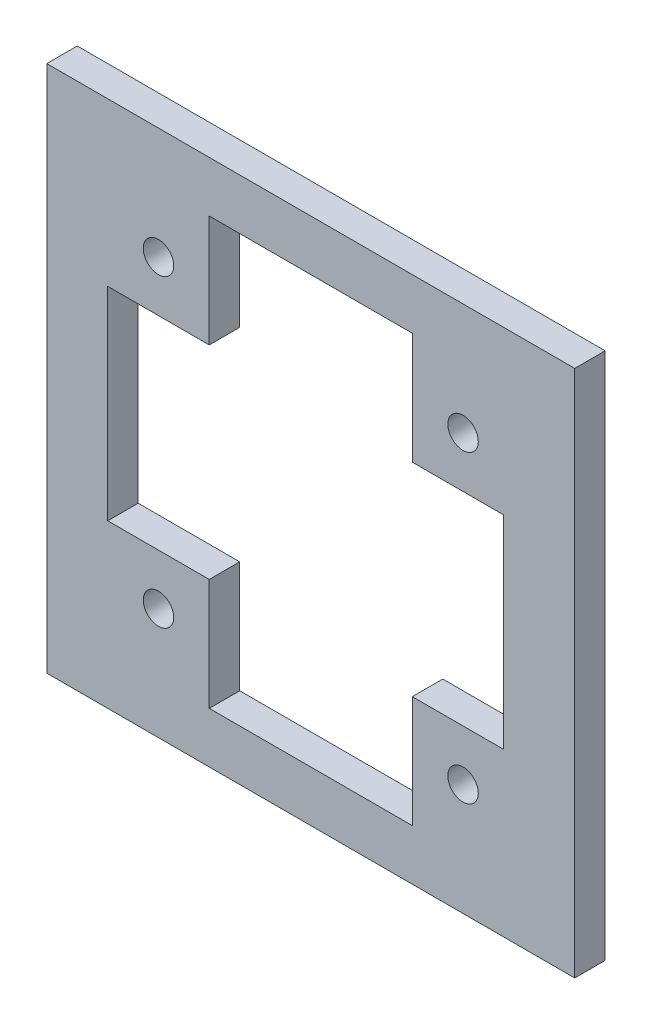
ISO-10303-21;
HEADER;
FILE_DESCRIPTION(('STEP AP214'),'2;1');
FILE_NAME('part.step','',(''),(''),'','','');
FILE_SCHEMA(('AUTOMOTIVE_DESIGN { 1 0 10303 214 1 1 1 1 }'));
ENDSEC;
DATA;
#1=APPLICATION_CONTEXT('core data for automotive mechanical design processes');
#2=APPLICATION_PROTOCOL_DEFINITION('international standard','automotive_design',2000,#1);
#3=PRODUCT_CONTEXT('',#1,'mechanical');
#4=PRODUCT('Part','Part','',(#3));
#5=PRODUCT_RELATED_PRODUCT_CATEGORY('part','',(#4));
#6=PRODUCT_DEFINITION_FORMATION('','',#4);
#7=PRODUCT_DEFINITION_CONTEXT('part definition',#1,'design');
#8=PRODUCT_DEFINITION('design','',#6,#7);
#9=PRODUCT_DEFINITION_SHAPE('','',#8);
#10=(LENGTH_UNIT() NAMED_UNIT(*) SI_UNIT(.MILLI.,.METRE.));
#11=(NAMED_UNIT(*) PLANE_ANGLE_UNIT() SI_UNIT($,.RADIAN.));
#12=(NAMED_UNIT(*) SI_UNIT($,.STERADIAN.) SOLID_ANGLE_UNIT());
#13=UNCERTAINTY_MEASURE_WITH_UNIT(LENGTH_MEASURE(1.E-05),#10,'distance_accuracy_value','');
#14=(GEOMETRIC_REPRESENTATION_CONTEXT(3) GLOBAL_UNCERTAINTY_ASSIGNED_CONTEXT((#13)) GLOBAL_UNIT_ASSIGNED_CONTEXT((#10,
#11,#12)) REPRESENTATION_CONTEXT('',''));
#15=CARTESIAN_POINT('',(0.,0.,0.));
#16=DIRECTION('',(0.,0.,1.));
#17=DIRECTION('',(1.,0.,0.));
#18=AXIS2_PLACEMENT_3D('',#15,#16,#17);
#19=CARTESIAN_POINT('',(0.,16.,3.));
#20=DIRECTION('',(0.,1.,0.));
#21=DIRECTION('',(0.,0.,1.));
#22=AXIS2_PLACEMENT_3D('',#19,#20,#21);
#23=PLANE('',#22);
#24=DIRECTION('',(1.,0.,0.));
#25=VECTOR('',#24,1.);
#26=CARTESIAN_POINT('',(0.,16.,0.));
#27=LINE('',#26,#25);
#28=CARTESIAN_POINT('',(36.,16.,0.));
#29=VERTEX_POINT('',#28);
#30=CARTESIAN_POINT('',(45.,16.,0.));
#31=VERTEX_POINT('',#30);
#32=EDGE_CURVE('E238',#29,#31,#27,.T.);
#33=ORIENTED_EDGE('',*,*,#32,.F.);
#34=DIRECTION('',(0.,0.,-1.));
#35=VECTOR('',#34,1.);
#36=CARTESIAN_POINT('',(36.,16.,3.));
#37=LINE('',#36,#35);
#38=CARTESIAN_POINT('',(36.,16.,3.));
#39=VERTEX_POINT('',#38);
#40=EDGE_CURVE('E11',#39,#29,#37,.T.);
#41=ORIENTED_EDGE('',*,*,#40,.F.);
#42=DIRECTION('',(1.,0.,0.));
#43=VECTOR('',#42,1.);
#44=CARTESIAN_POINT('',(0.,16.,3.));
#45=LINE('',#44,#43);
#46=CARTESIAN_POINT('',(45.,16.,3.));
#47=VERTEX_POINT('',#46);
#48=EDGE_CURVE('E282',#39,#47,#45,.T.);
#49=ORIENTED_EDGE('',*,*,#48,.T.);
#50=DIRECTION('',(0.,0.,-1.));
#51=VECTOR('',#50,1.);
#52=CARTESIAN_POINT('',(45.,16.,3.));
#53=LINE('',#52,#51);
#54=EDGE_CURVE('E51',#47,#31,#53,.T.);
#55=ORIENTED_EDGE('',*,*,#54,.T.);
#56=EDGE_LOOP('',(#33,#41,#49,#55));
#57=FACE_BOUND('',#56,.T.);
#58=ADVANCED_FACE('F32',(#57),#23,.T.);
#59=CARTESIAN_POINT('',(36.,0.,3.));
#60=DIRECTION('',(1.,0.,0.));
#61=DIRECTION('',(0.,0.,-1.));
#62=AXIS2_PLACEMENT_3D('',#59,#60,#61);
#63=PLANE('',#62);
#64=DIRECTION('',(0.,-1.,0.));
#65=VECTOR('',#64,1.);
#66=CARTESIAN_POINT('',(36.,0.,0.));
#67=LINE('',#66,#65);
#68=CARTESIAN_POINT('',(36.,5.,0.));
#69=VERTEX_POINT('',#68);
#70=EDGE_CURVE('E235',#29,#69,#67,.T.);
#71=ORIENTED_EDGE('',*,*,#70,.T.);
#72=DIRECTION('',(0.,0.,-1.));
#73=VECTOR('',#72,1.);
#74=CARTESIAN_POINT('',(36.,5.,3.));
#75=LINE('',#74,#73);
#76=CARTESIAN_POINT('',(36.,5.,3.));
#77=VERTEX_POINT('',#76);
#78=EDGE_CURVE('E42',#77,#69,#75,.T.);
#79=ORIENTED_EDGE('',*,*,#78,.F.);
#80=DIRECTION('',(0.,-1.,0.));
#81=VECTOR('',#80,1.);
#82=CARTESIAN_POINT('',(36.,0.,3.));
#83=LINE('',#82,#81);
#84=EDGE_CURVE('E280',#39,#77,#83,.T.);
#85=ORIENTED_EDGE('',*,*,#84,.F.);
#86=ORIENTED_EDGE('',*,*,#40,.T.);
#87=EDGE_LOOP('',(#71,#79,#85,#86));
#88=FACE_BOUND('',#87,.T.);
#89=ADVANCED_FACE('F340',(#88),#63,.F.);
#90=CARTESIAN_POINT('',(0.,5.,3.));
#91=DIRECTION('',(0.,1.,0.));
#92=DIRECTION('',(0.,0.,1.));
#93=AXIS2_PLACEMENT_3D('',#90,#91,#92);
#94=PLANE('',#93);
#95=DIRECTION('',(1.,0.,0.));
#96=VECTOR('',#95,1.);
#97=CARTESIAN_POINT('',(0.,5.,0.));
#98=LINE('',#97,#96);
#99=CARTESIAN_POINT('',(16.,5.,0.));
#100=VERTEX_POINT('',#99);
#101=EDGE_CURVE('E232',#100,#69,#98,.T.);
#102=ORIENTED_EDGE('',*,*,#101,.F.);
#103=DIRECTION('',(0.,0.,-1.));
#104=VECTOR('',#103,1.);
#105=CARTESIAN_POINT('',(16.,5.,3.));
#106=LINE('',#105,#104);
#107=CARTESIAN_POINT('',(16.,5.,3.));
#108=VERTEX_POINT('',#107);
#109=EDGE_CURVE('E192',#108,#100,#106,.T.);
#110=ORIENTED_EDGE('',*,*,#109,.F.);
#111=DIRECTION('',(1.,0.,0.));
#112=VECTOR('',#111,1.);
#113=CARTESIAN_POINT('',(0.,5.,3.));
#114=LINE('',#113,#112);
#115=EDGE_CURVE('E277',#108,#77,#114,.T.);
#116=ORIENTED_EDGE('',*,*,#115,.T.);
#117=ORIENTED_EDGE('',*,*,#78,.T.);
#118=EDGE_LOOP('',(#102,#110,#116,#117));
#119=FACE_BOUND('',#118,.T.);
#120=ADVANCED_FACE('F345',(#119),#94,.T.);
#121=CARTESIAN_POINT('',(16.,0.,3.));
#122=DIRECTION('',(1.,0.,0.));
#123=DIRECTION('',(0.,0.,-1.));
#124=AXIS2_PLACEMENT_3D('',#121,#122,#123);
#125=PLANE('',#124);
#126=DIRECTION('',(0.,-1.,0.));
#127=VECTOR('',#126,1.);
#128=CARTESIAN_POINT('',(16.,0.,0.));
#129=LINE('',#128,#127);
#130=CARTESIAN_POINT('',(16.,16.,0.));
#131=VERTEX_POINT('',#130);
#132=EDGE_CURVE('E229',#131,#100,#129,.T.);
#133=ORIENTED_EDGE('',*,*,#132,.F.);
#134=DIRECTION('',(0.,0.,-1.));
#135=VECTOR('',#134,1.);
#136=CARTESIAN_POINT('',(16.,16.,3.));
#137=LINE('',#136,#135);
#138=CARTESIAN_POINT('',(16.,16.,3.));
#139=VERTEX_POINT('',#138);
#140=EDGE_CURVE('E190',#139,#131,#137,.T.);
#141=ORIENTED_EDGE('',*,*,#140,.F.);
#142=DIRECTION('',(0.,-1.,0.));
#143=VECTOR('',#142,1.);
#144=CARTESIAN_POINT('',(16.,0.,3.));
#145=LINE('',#144,#143);
#146=EDGE_CURVE('E274',#139,#108,#145,.T.);
#147=ORIENTED_EDGE('',*,*,#146,.T.);
#148=ORIENTED_EDGE('',*,*,#109,.T.);
#149=EDGE_LOOP('',(#133,#141,#147,#148));
#150=FACE_BOUND('',#149,.T.);
#151=ADVANCED_FACE('F351',(#150),#125,.T.);
#152=CARTESIAN_POINT('',(0.,16.,3.));
#153=DIRECTION('',(0.,1.,0.));
#154=DIRECTION('',(0.,0.,1.));
#155=AXIS2_PLACEMENT_3D('',#152,#153,#154);
#156=PLANE('',#155);
#157=DIRECTION('',(1.,0.,0.));
#158=VECTOR('',#157,1.);
#159=CARTESIAN_POINT('',(0.,16.,0.));
#160=LINE('',#159,#158);
#161=CARTESIAN_POINT('',(6.00000000000001,16.,0.));
#162=VERTEX_POINT('',#161);
#163=EDGE_CURVE('E226',#162,#131,#160,.T.);
#164=ORIENTED_EDGE('',*,*,#163,.F.);
#165=DIRECTION('',(0.,0.,-1.));
#166=VECTOR('',#165,1.);
#167=CARTESIAN_POINT('',(6.00000000000001,16.,3.));
#168=LINE('',#167,#166);
#169=CARTESIAN_POINT('',(6.00000000000001,16.,3.));
#170=VERTEX_POINT('',#169);
#171=EDGE_CURVE('E188',#170,#162,#168,.T.);
#172=ORIENTED_EDGE('',*,*,#171,.F.);
#173=DIRECTION('',(1.,0.,0.));
#174=VECTOR('',#173,1.);
#175=CARTESIAN_POINT('',(0.,16.,3.));
#176=LINE('',#175,#174);
#177=EDGE_CURVE('E271',#170,#139,#176,.T.);
#178=ORIENTED_EDGE('',*,*,#177,.T.);
#179=ORIENTED_EDGE('',*,*,#140,.T.);
#180=EDGE_LOOP('',(#164,#172,#178,#179));
#181=FACE_BOUND('',#180,.T.);
#182=ADVANCED_FACE('F355',(#181),#156,.T.);
#183=CARTESIAN_POINT('',(6.00000000000001,0.,3.));
#184=DIRECTION('',(1.,0.,0.));
#185=DIRECTION('',(0.,0.,-1.));
#186=AXIS2_PLACEMENT_3D('',#183,#184,#185);
#187=PLANE('',#186);
#188=DIRECTION('',(0.,-1.,0.));
#189=VECTOR('',#188,1.);
#190=CARTESIAN_POINT('',(6.00000000000001,0.,0.));
#191=LINE('',#190,#189);
#192=CARTESIAN_POINT('',(6.00000000000001,36.,0.));
#193=VERTEX_POINT('',#192);
#194=EDGE_CURVE('E223',#193,#162,#191,.T.);
#195=ORIENTED_EDGE('',*,*,#194,.F.);
#196=DIRECTION('',(0.,0.,-1.));
#197=VECTOR('',#196,1.);
#198=CARTESIAN_POINT('',(6.00000000000001,36.,3.));
#199=LINE('',#198,#197);
#200=CARTESIAN_POINT('',(6.00000000000001,36.,3.));
#201=VERTEX_POINT('',#200);
#202=EDGE_CURVE('E186',#201,#193,#199,.T.);
#203=ORIENTED_EDGE('',*,*,#202,.F.);
#204=DIRECTION('',(0.,-1.,0.));
#205=VECTOR('',#204,1.);
#206=CARTESIAN_POINT('',(6.00000000000001,0.,3.));
#207=LINE('',#206,#205);
#208=EDGE_CURVE('E268',#201,#170,#207,.T.);
#209=ORIENTED_EDGE('',*,*,#208,.T.);
#210=ORIENTED_EDGE('',*,*,#171,.T.);
#211=EDGE_LOOP('',(#195,#203,#209,#210));
#212=FACE_BOUND('',#211,.T.);
#213=ADVANCED_FACE('F359',(#212),#187,.T.);
#214=CARTESIAN_POINT('',(0.,36.,3.));
#215=DIRECTION('',(0.,1.,0.));
#216=DIRECTION('',(0.,0.,1.));
#217=AXIS2_PLACEMENT_3D('',#214,#215,#216);
#218=PLANE('',#217);
#219=DIRECTION('',(1.,0.,0.));
#220=VECTOR('',#219,1.);
#221=CARTESIAN_POINT('',(0.,36.,0.));
#222=LINE('',#221,#220);
#223=CARTESIAN_POINT('',(16.,36.,0.));
#224=VERTEX_POINT('',#223);
#225=EDGE_CURVE('E220',#193,#224,#222,.T.);
#226=ORIENTED_EDGE('',*,*,#225,.T.);
#227=DIRECTION('',(0.,0.,-1.));
#228=VECTOR('',#227,1.);
#229=CARTESIAN_POINT('',(16.,36.,3.));
#230=LINE('',#229,#228);
#231=CARTESIAN_POINT('',(16.,36.,3.));
#232=VERTEX_POINT('',#231);
#233=EDGE_CURVE('E184',#232,#224,#230,.T.);
#234=ORIENTED_EDGE('',*,*,#233,.F.);
#235=DIRECTION('',(1.,0.,0.));
#236=VECTOR('',#235,1.);
#237=CARTESIAN_POINT('',(0.,36.,3.));
#238=LINE('',#237,#236);
#239=EDGE_CURVE('E266',#201,#232,#238,.T.);
#240=ORIENTED_EDGE('',*,*,#239,.F.);
#241=ORIENTED_EDGE('',*,*,#202,.T.);
#242=EDGE_LOOP('',(#226,#234,#240,#241));
#243=FACE_BOUND('',#242,.T.);
#244=ADVANCED_FACE('F363',(#243),#218,.F.);
#245=CARTESIAN_POINT('',(16.,0.,3.));
#246=DIRECTION('',(1.,0.,0.));
#247=DIRECTION('',(0.,0.,-1.));
#248=AXIS2_PLACEMENT_3D('',#245,#246,#247);
#249=PLANE('',#248);
#250=DIRECTION('',(0.,-1.,0.));
#251=VECTOR('',#250,1.);
#252=CARTESIAN_POINT('',(16.,0.,0.));
#253=LINE('',#252,#251);
#254=CARTESIAN_POINT('',(16.,47.,0.));
#255=VERTEX_POINT('',#254);
#256=EDGE_CURVE('E217',#255,#224,#253,.T.);
#257=ORIENTED_EDGE('',*,*,#256,.F.);
#258=DIRECTION('',(0.,0.,-1.));
#259=VECTOR('',#258,1.);
#260=CARTESIAN_POINT('',(16.,47.,3.));
#261=LINE('',#260,#259);
#262=CARTESIAN_POINT('',(16.,47.,3.));
#263=VERTEX_POINT('',#262);
#264=EDGE_CURVE('E178',#263,#255,#261,.T.);
#265=ORIENTED_EDGE('',*,*,#264,.F.);
#266=DIRECTION('',(0.,-1.,0.));
#267=VECTOR('',#266,1.);
#268=CARTESIAN_POINT('',(16.,0.,3.));
#269=LINE('',#268,#267);
#270=EDGE_CURVE('E263',#263,#232,#269,.T.);
#271=ORIENTED_EDGE('',*,*,#270,.T.);
#272=ORIENTED_EDGE('',*,*,#233,.T.);
#273=EDGE_LOOP('',(#257,#265,#271,#272));
#274=FACE_BOUND('',#273,.T.);
#275=ADVANCED_FACE('F367',(#274),#249,.T.);
#276=CARTESIAN_POINT('',(0.,47.,3.));
#277=DIRECTION('',(0.,1.,0.));
#278=DIRECTION('',(0.,0.,1.));
#279=AXIS2_PLACEMENT_3D('',#276,#277,#278);
#280=PLANE('',#279);
#281=DIRECTION('',(1.,0.,0.));
#282=VECTOR('',#281,1.);
#283=CARTESIAN_POINT('',(0.,47.,0.));
#284=LINE('',#283,#282);
#285=CARTESIAN_POINT('',(36.,47.,0.));
#286=VERTEX_POINT('',#285);
#287=EDGE_CURVE('E214',#255,#286,#284,.T.);
#288=ORIENTED_EDGE('',*,*,#287,.T.);
#289=DIRECTION('',(0.,0.,-1.));
#290=VECTOR('',#289,1.);
#291=CARTESIAN_POINT('',(36.,47.,3.));
#292=LINE('',#291,#290);
#293=CARTESIAN_POINT('',(36.,47.,3.));
#294=VERTEX_POINT('',#293);
#295=EDGE_CURVE('E176',#294,#286,#292,.T.);
#296=ORIENTED_EDGE('',*,*,#295,.F.);
#297=DIRECTION('',(1.,0.,0.));
#298=VECTOR('',#297,1.);
#299=CARTESIAN_POINT('',(0.,47.,3.));
#300=LINE('',#299,#298);
#301=EDGE_CURVE('E169',#263,#294,#300,.T.);
#302=ORIENTED_EDGE('',*,*,#301,.F.);
#303=ORIENTED_EDGE('',*,*,#264,.T.);
#304=EDGE_LOOP('',(#288,#296,#302,#303));
#305=FACE_BOUND('',#304,.T.);
#306=ADVANCED_FACE('F371',(#305),#280,.F.);
#307=CARTESIAN_POINT('',(36.,0.,3.));
#308=DIRECTION('',(1.,0.,0.));
#309=DIRECTION('',(0.,0.,-1.));
#310=AXIS2_PLACEMENT_3D('',#307,#308,#309);
#311=PLANE('',#310);
#312=DIRECTION('',(0.,-1.,0.));
#313=VECTOR('',#312,1.);
#314=CARTESIAN_POINT('',(36.,0.,0.));
#315=LINE('',#314,#313);
#316=CARTESIAN_POINT('',(36.,36.,0.));
#317=VERTEX_POINT('',#316);
#318=EDGE_CURVE('E175',#286,#317,#315,.T.);
#319=ORIENTED_EDGE('',*,*,#318,.T.);
#320=DIRECTION('',(0.,0.,-1.));
#321=VECTOR('',#320,1.);
#322=CARTESIAN_POINT('',(36.,36.,3.));
#323=LINE('',#322,#321);
#324=CARTESIAN_POINT('',(36.,36.,3.));
#325=VERTEX_POINT('',#324);
#326=EDGE_CURVE('E157',#325,#317,#323,.T.);
#327=ORIENTED_EDGE('',*,*,#326,.F.);
#328=DIRECTION('',(0.,-1.,0.));
#329=VECTOR('',#328,1.);
#330=CARTESIAN_POINT('',(36.,0.,3.));
#331=LINE('',#330,#329);
#332=EDGE_CURVE('E162',#294,#325,#331,.T.);
#333=ORIENTED_EDGE('',*,*,#332,.F.);
#334=ORIENTED_EDGE('',*,*,#295,.T.);
#335=EDGE_LOOP('',(#319,#327,#333,#334));
#336=FACE_BOUND('',#335,.T.);
#337=ADVANCED_FACE('F174',(#336),#311,.F.);
#338=CARTESIAN_POINT('',(0.,36.,3.));
#339=DIRECTION('',(0.,1.,0.));
#340=DIRECTION('',(0.,0.,1.));
#341=AXIS2_PLACEMENT_3D('',#338,#339,#340);
#342=PLANE('',#341);
#343=DIRECTION('',(1.,0.,0.));
#344=VECTOR('',#343,1.);
#345=CARTESIAN_POINT('',(0.,36.,0.));
#346=LINE('',#345,#344);
#347=CARTESIAN_POINT('',(45.,36.,0.));
#348=VERTEX_POINT('',#347);
#349=EDGE_CURVE('E211',#317,#348,#346,.T.);
#350=ORIENTED_EDGE('',*,*,#349,.T.);
#351=DIRECTION('',(0.,0.,-1.));
#352=VECTOR('',#351,1.);
#353=CARTESIAN_POINT('',(45.,36.,3.));
#354=LINE('',#353,#352);
#355=CARTESIAN_POINT('',(45.,36.,3.));
#356=VERTEX_POINT('',#355);
#357=EDGE_CURVE('E101',#356,#348,#354,.T.);
#358=ORIENTED_EDGE('',*,*,#357,.F.);
#359=DIRECTION('',(1.,0.,0.));
#360=VECTOR('',#359,1.);
#361=CARTESIAN_POINT('',(0.,36.,3.));
#362=LINE('',#361,#360);
#363=EDGE_CURVE('E153',#325,#356,#362,.T.);
#364=ORIENTED_EDGE('',*,*,#363,.F.);
#365=ORIENTED_EDGE('',*,*,#326,.T.);
#366=EDGE_LOOP('',(#350,#358,#364,#365));
#367=FACE_BOUND('',#366,.T.);
#368=ADVANCED_FACE('F155',(#367),#342,.F.);
#369=CARTESIAN_POINT('',(0.,0.,3.));
#370=DIRECTION('',(1.,0.,0.));
#371=DIRECTION('',(0.,0.,-1.));
#372=AXIS2_PLACEMENT_3D('',#369,#370,#371);
#373=PLANE('',#372);
#374=DIRECTION('',(0.,-1.,0.));
#375=VECTOR('',#374,1.);
#376=CARTESIAN_POINT('',(0.,0.,0.));
#377=LINE('',#376,#375);
#378=CARTESIAN_POINT('',(0.,52.,0.));
#379=VERTEX_POINT('',#378);
#380=CARTESIAN_POINT('',(0.,0.,0.));
#381=VERTEX_POINT('',#380);
#382=EDGE_CURVE('E247',#379,#381,#377,.T.);
#383=ORIENTED_EDGE('',*,*,#382,.T.);
#384=DIRECTION('',(0.,0.,-1.));
#385=VECTOR('',#384,1.);
#386=CARTESIAN_POINT('',(0.,0.,3.));
#387=LINE('',#386,#385);
#388=CARTESIAN_POINT('',(0.,0.,3.));
#389=VERTEX_POINT('',#388);
#390=EDGE_CURVE('E36',#389,#381,#387,.T.);
#391=ORIENTED_EDGE('',*,*,#390,.F.);
#392=DIRECTION('',(0.,-1.,0.));
#393=VECTOR('',#392,1.);
#394=CARTESIAN_POINT('',(0.,0.,3.));
#395=LINE('',#394,#393);
#396=CARTESIAN_POINT('',(0.,52.,3.));
#397=VERTEX_POINT('',#396);
#398=EDGE_CURVE('E290',#397,#389,#395,.T.);
#399=ORIENTED_EDGE('',*,*,#398,.F.);
#400=DIRECTION('',(0.,0.,-1.));
#401=VECTOR('',#400,1.);
#402=CARTESIAN_POINT('',(0.,52.,3.));
#403=LINE('',#402,#401);
#404=EDGE_CURVE('E195',#397,#379,#403,.T.);
#405=ORIENTED_EDGE('',*,*,#404,.T.);
#406=EDGE_LOOP('',(#383,#391,#399,#405));
#407=FACE_BOUND('',#406,.T.);
#408=ADVANCED_FACE('F320',(#407),#373,.F.);
#409=CARTESIAN_POINT('',(0.,0.,3.));
#410=DIRECTION('',(0.,1.,0.));
#411=DIRECTION('',(0.,0.,1.));
#412=AXIS2_PLACEMENT_3D('',#409,#410,#411);
#413=PLANE('',#412);
#414=DIRECTION('',(1.,0.,0.));
#415=VECTOR('',#414,1.);
#416=CARTESIAN_POINT('',(0.,0.,0.));
#417=LINE('',#416,#415);
#418=CARTESIAN_POINT('',(52.,0.,0.));
#419=VERTEX_POINT('',#418);
#420=EDGE_CURVE('E245',#381,#419,#417,.T.);
#421=ORIENTED_EDGE('',*,*,#420,.T.);
#422=DIRECTION('',(0.,0.,-1.));
#423=VECTOR('',#422,1.);
#424=CARTESIAN_POINT('',(52.,0.,3.));
#425=LINE('',#424,#423);
#426=CARTESIAN_POINT('',(52.,0.,3.));
#427=VERTEX_POINT('',#426);
#428=EDGE_CURVE('E198',#427,#419,#425,.T.);
#429=ORIENTED_EDGE('',*,*,#428,.F.);
#430=DIRECTION('',(1.,0.,0.));
#431=VECTOR('',#430,1.);
#432=CARTESIAN_POINT('',(0.,0.,3.));
#433=LINE('',#432,#431);
#434=EDGE_CURVE('E114',#389,#427,#433,.T.);
#435=ORIENTED_EDGE('',*,*,#434,.F.);
#436=ORIENTED_EDGE('',*,*,#390,.T.);
#437=EDGE_LOOP('',(#421,#429,#435,#436));
#438=FACE_BOUND('',#437,.T.);
#439=ADVANCED_FACE('F330',(#438),#413,.F.);
#440=CARTESIAN_POINT('',(52.,0.,3.));
#441=DIRECTION('',(-1.,0.,0.));
#442=DIRECTION('',(0.,0.,1.));
#443=AXIS2_PLACEMENT_3D('',#440,#441,#442);
#444=PLANE('',#443);
#445=DIRECTION('',(0.,1.,0.));
#446=VECTOR('',#445,1.);
#447=CARTESIAN_POINT('',(52.,0.,0.));
#448=LINE('',#447,#446);
#449=CARTESIAN_POINT('',(52.,52.,0.));
#450=VERTEX_POINT('',#449);
#451=EDGE_CURVE('E243',#419,#450,#448,.T.);
#452=ORIENTED_EDGE('',*,*,#451,.T.);
#453=DIRECTION('',(0.,0.,-1.));
#454=VECTOR('',#453,1.);
#455=CARTESIAN_POINT('',(52.,52.,3.));
#456=LINE('',#455,#454);
#457=CARTESIAN_POINT('',(52.,52.,3.));
#458=VERTEX_POINT('',#457);
#459=EDGE_CURVE('E197',#458,#450,#456,.T.);
#460=ORIENTED_EDGE('',*,*,#459,.F.);
#461=DIRECTION('',(0.,1.,0.));
#462=VECTOR('',#461,1.);
#463=CARTESIAN_POINT('',(52.,0.,3.));
#464=LINE('',#463,#462);
#465=EDGE_CURVE('E287',#427,#458,#464,.T.);
#466=ORIENTED_EDGE('',*,*,#465,.F.);
#467=ORIENTED_EDGE('',*,*,#428,.T.);
#468=EDGE_LOOP('',(#452,#460,#466,#467));
#469=FACE_BOUND('',#468,.T.);
#470=ADVANCED_FACE('F328',(#469),#444,.F.);
#471=CARTESIAN_POINT('',(0.,52.,3.));
#472=DIRECTION('',(0.,1.,0.));
#473=DIRECTION('',(0.,0.,1.));
#474=AXIS2_PLACEMENT_3D('',#471,#472,#473);
#475=PLANE('',#474);
#476=DIRECTION('',(1.,0.,0.));
#477=VECTOR('',#476,1.);
#478=CARTESIAN_POINT('',(0.,52.,0.));
#479=LINE('',#478,#477);
#480=EDGE_CURVE('E240',#379,#450,#479,.T.);
#481=ORIENTED_EDGE('',*,*,#480,.F.);
#482=ORIENTED_EDGE('',*,*,#404,.F.);
#483=DIRECTION('',(1.,0.,0.));
#484=VECTOR('',#483,1.);
#485=CARTESIAN_POINT('',(0.,52.,3.));
#486=LINE('',#485,#484);
#487=EDGE_CURVE('E284',#397,#458,#486,.T.);
#488=ORIENTED_EDGE('',*,*,#487,.T.);
#489=ORIENTED_EDGE('',*,*,#459,.T.);
#490=EDGE_LOOP('',(#481,#482,#488,#489));
#491=FACE_BOUND('',#490,.T.);
#492=ADVANCED_FACE('F326',(#491),#475,.T.);
#493=CARTESIAN_POINT('',(11.,41.,3.));
#494=DIRECTION('',(0.,0.,-1.));
#495=DIRECTION('',(-1.,0.,0.));
#496=AXIS2_PLACEMENT_3D('',#493,#494,#495);
#497=CYLINDRICAL_SURFACE('',#496,1.5);
#498=CARTESIAN_POINT('',(11.,41.,3.));
#499=DIRECTION('',(0.,0.,1.));
#500=DIRECTION('',(1.,0.,0.));
#501=AXIS2_PLACEMENT_3D('',#498,#499,#500);
#502=CIRCLE('',#501,1.5);
#503=CARTESIAN_POINT('',(12.5,41.,3.));
#504=VERTEX_POINT('',#503);
#505=EDGE_CURVE('E292',#504,#504,#502,.T.);
#506=ORIENTED_EDGE('',*,*,#505,.T.);
#507=EDGE_LOOP('',(#506));
#508=FACE_BOUND('',#507,.T.);
#509=CARTESIAN_POINT('',(11.,41.,0.));
#510=DIRECTION('',(0.,0.,1.));
#511=DIRECTION('',(1.,0.,0.));
#512=AXIS2_PLACEMENT_3D('',#509,#510,#511);
#513=CIRCLE('',#512,1.5);
#514=CARTESIAN_POINT('',(12.5,41.,0.));
#515=VERTEX_POINT('',#514);
#516=EDGE_CURVE('E249',#515,#515,#513,.T.);
#517=ORIENTED_EDGE('',*,*,#516,.F.);
#518=EDGE_LOOP('',(#517));
#519=FACE_BOUND('',#518,.T.);
#520=ADVANCED_FACE('F336',(#508,#519),#497,.F.);
#521=CARTESIAN_POINT('',(11.,11.,3.));
#522=DIRECTION('',(0.,0.,-1.));
#523=DIRECTION('',(-1.,0.,0.));
#524=AXIS2_PLACEMENT_3D('',#521,#522,#523);
#525=CYLINDRICAL_SURFACE('',#524,1.5);
#526=CARTESIAN_POINT('',(11.,11.,3.));
#527=DIRECTION('',(0.,0.,1.));
#528=DIRECTION('',(1.,0.,0.));
#529=AXIS2_PLACEMENT_3D('',#526,#527,#528);
#530=CIRCLE('',#529,1.5);
#531=CARTESIAN_POINT('',(12.5,11.,3.));
#532=VERTEX_POINT('',#531);
#533=EDGE_CURVE('E295',#532,#532,#530,.T.);
#534=ORIENTED_EDGE('',*,*,#533,.T.);
#535=EDGE_LOOP('',(#534));
#536=FACE_BOUND('',#535,.T.);
#537=CARTESIAN_POINT('',(11.,11.,0.));
#538=DIRECTION('',(0.,0.,1.));
#539=DIRECTION('',(1.,0.,0.));
#540=AXIS2_PLACEMENT_3D('',#537,#538,#539);
#541=CIRCLE('',#540,1.5);
#542=CARTESIAN_POINT('',(12.5,11.,0.));
#543=VERTEX_POINT('',#542);
#544=EDGE_CURVE('E252',#543,#543,#541,.T.);
#545=ORIENTED_EDGE('',*,*,#544,.F.);
#546=EDGE_LOOP('',(#545));
#547=FACE_BOUND('',#546,.T.);
#548=ADVANCED_FACE('F395',(#536,#547),#525,.F.);
#549=CARTESIAN_POINT('',(41.,11.,3.));
#550=DIRECTION('',(0.,0.,-1.));
#551=DIRECTION('',(-1.,0.,0.));
#552=AXIS2_PLACEMENT_3D('',#549,#550,#551);
#553=CYLINDRICAL_SURFACE('',#552,1.5);
#554=CARTESIAN_POINT('',(41.,11.,3.));
#555=DIRECTION('',(0.,0.,1.));
#556=DIRECTION('',(1.,0.,0.));
#557=AXIS2_PLACEMENT_3D('',#554,#555,#556);
#558=CIRCLE('',#557,1.5);
#559=CARTESIAN_POINT('',(42.5,11.,3.));
#560=VERTEX_POINT('',#559);
#561=EDGE_CURVE('E298',#560,#560,#558,.T.);
#562=ORIENTED_EDGE('',*,*,#561,.T.);
#563=EDGE_LOOP('',(#562));
#564=FACE_BOUND('',#563,.T.);
#565=CARTESIAN_POINT('',(41.,11.,0.));
#566=DIRECTION('',(0.,0.,1.));
#567=DIRECTION('',(1.,0.,0.));
#568=AXIS2_PLACEMENT_3D('',#565,#566,#567);
#569=CIRCLE('',#568,1.5);
#570=CARTESIAN_POINT('',(42.5,11.,0.));
#571=VERTEX_POINT('',#570);
#572=EDGE_CURVE('E255',#571,#571,#569,.T.);
#573=ORIENTED_EDGE('',*,*,#572,.F.);
#574=EDGE_LOOP('',(#573));
#575=FACE_BOUND('',#574,.T.);
#576=ADVANCED_FACE('F401',(#564,#575),#553,.F.);
#577=CARTESIAN_POINT('',(41.,41.,3.));
#578=DIRECTION('',(0.,0.,-1.));
#579=DIRECTION('',(-1.,0.,0.));
#580=AXIS2_PLACEMENT_3D('',#577,#578,#579);
#581=CYLINDRICAL_SURFACE('',#580,1.5);
#582=CARTESIAN_POINT('',(41.,41.,3.));
#583=DIRECTION('',(0.,0.,1.));
#584=DIRECTION('',(1.,0.,0.));
#585=AXIS2_PLACEMENT_3D('',#582,#583,#584);
#586=CIRCLE('',#585,1.5);
#587=CARTESIAN_POINT('',(42.5,41.,3.));
#588=VERTEX_POINT('',#587);
#589=EDGE_CURVE('E210',#588,#588,#586,.T.);
#590=ORIENTED_EDGE('',*,*,#589,.T.);
#591=EDGE_LOOP('',(#590));
#592=FACE_BOUND('',#591,.T.);
#593=CARTESIAN_POINT('',(41.,41.,0.));
#594=DIRECTION('',(0.,0.,1.));
#595=DIRECTION('',(1.,0.,0.));
#596=AXIS2_PLACEMENT_3D('',#593,#594,#595);
#597=CIRCLE('',#596,1.5);
#598=CARTESIAN_POINT('',(42.5,41.,0.));
#599=VERTEX_POINT('',#598);
#600=EDGE_CURVE('E258',#599,#599,#597,.T.);
#601=ORIENTED_EDGE('',*,*,#600,.F.);
#602=EDGE_LOOP('',(#601));
#603=FACE_BOUND('',#602,.T.);
#604=ADVANCED_FACE('F34',(#592,#603),#581,.F.);
#605=CARTESIAN_POINT('',(45.,0.,3.));
#606=DIRECTION('',(-1.,0.,0.));
#607=DIRECTION('',(0.,0.,1.));
#608=AXIS2_PLACEMENT_3D('',#605,#606,#607);
#609=PLANE('',#608);
#610=DIRECTION('',(0.,1.,0.));
#611=VECTOR('',#610,1.);
#612=CARTESIAN_POINT('',(45.,0.,0.));
#613=LINE('',#612,#611);
#614=EDGE_CURVE('E207',#31,#348,#613,.T.);
#615=ORIENTED_EDGE('',*,*,#614,.F.);
#616=ORIENTED_EDGE('',*,*,#54,.F.);
#617=DIRECTION('',(0.,1.,0.));
#618=VECTOR('',#617,1.);
#619=CARTESIAN_POINT('',(45.,0.,3.));
#620=LINE('',#619,#618);
#621=EDGE_CURVE('E161',#47,#356,#620,.T.);
#622=ORIENTED_EDGE('',*,*,#621,.T.);
#623=ORIENTED_EDGE('',*,*,#357,.T.);
#624=EDGE_LOOP('',(#615,#616,#622,#623));
#625=FACE_BOUND('',#624,.T.);
#626=ADVANCED_FACE('F309',(#625),#609,.T.);
#627=CARTESIAN_POINT('',(0.,0.,3.));
#628=DIRECTION('',(0.,0.,1.));
#629=DIRECTION('',(1.,0.,0.));
#630=AXIS2_PLACEMENT_3D('',#627,#628,#629);
#631=PLANE('',#630);
#632=ORIENTED_EDGE('',*,*,#589,.F.);
#633=EDGE_LOOP('',(#632));
#634=FACE_BOUND('',#633,.T.);
#635=ORIENTED_EDGE('',*,*,#561,.F.);
#636=EDGE_LOOP('',(#635));
#637=FACE_BOUND('',#636,.T.);
#638=ORIENTED_EDGE('',*,*,#533,.F.);
#639=EDGE_LOOP('',(#638));
#640=FACE_BOUND('',#639,.T.);
#641=ORIENTED_EDGE('',*,*,#505,.F.);
#642=EDGE_LOOP('',(#641));
#643=FACE_BOUND('',#642,.T.);
#644=ORIENTED_EDGE('',*,*,#398,.T.);
#645=ORIENTED_EDGE('',*,*,#434,.T.);
#646=ORIENTED_EDGE('',*,*,#465,.T.);
#647=ORIENTED_EDGE('',*,*,#487,.F.);
#648=EDGE_LOOP('',(#644,#645,#646,#647));
#649=FACE_BOUND('',#648,.T.);
#650=ORIENTED_EDGE('',*,*,#48,.F.);
#651=ORIENTED_EDGE('',*,*,#84,.T.);
#652=ORIENTED_EDGE('',*,*,#115,.F.);
#653=ORIENTED_EDGE('',*,*,#146,.F.);
#654=ORIENTED_EDGE('',*,*,#177,.F.);
#655=ORIENTED_EDGE('',*,*,#208,.F.);
#656=ORIENTED_EDGE('',*,*,#239,.T.);
#657=ORIENTED_EDGE('',*,*,#270,.F.);
#658=ORIENTED_EDGE('',*,*,#301,.T.);
#659=ORIENTED_EDGE('',*,*,#332,.T.);
#660=ORIENTED_EDGE('',*,*,#363,.T.);
#661=ORIENTED_EDGE('',*,*,#621,.F.);
#662=EDGE_LOOP('',(#650,#651,#652,#653,#654,#655,#656,#657,#658,#659,#660,#661));
#663=FACE_BOUND('',#662,.T.);
#664=ADVANCED_FACE('F166',(#634,#637,#640,#643,#649,#663),#631,.T.);
#665=CARTESIAN_POINT('',(0.,0.,0.));
#666=DIRECTION('',(0.,0.,1.));
#667=DIRECTION('',(1.,0.,0.));
#668=AXIS2_PLACEMENT_3D('',#665,#666,#667);
#669=PLANE('',#668);
#670=ORIENTED_EDGE('',*,*,#600,.T.);
#671=EDGE_LOOP('',(#670));
#672=FACE_BOUND('',#671,.T.);
#673=ORIENTED_EDGE('',*,*,#572,.T.);
#674=EDGE_LOOP('',(#673));
#675=FACE_BOUND('',#674,.T.);
#676=ORIENTED_EDGE('',*,*,#544,.T.);
#677=EDGE_LOOP('',(#676));
#678=FACE_BOUND('',#677,.T.);
#679=ORIENTED_EDGE('',*,*,#516,.T.);
#680=EDGE_LOOP('',(#679));
#681=FACE_BOUND('',#680,.T.);
#682=ORIENTED_EDGE('',*,*,#382,.F.);
#683=ORIENTED_EDGE('',*,*,#480,.T.);
#684=ORIENTED_EDGE('',*,*,#451,.F.);
#685=ORIENTED_EDGE('',*,*,#420,.F.);
#686=EDGE_LOOP('',(#682,#683,#684,#685));
#687=FACE_BOUND('',#686,.T.);
#688=ORIENTED_EDGE('',*,*,#32,.T.);
#689=ORIENTED_EDGE('',*,*,#614,.T.);
#690=ORIENTED_EDGE('',*,*,#349,.F.);
#691=ORIENTED_EDGE('',*,*,#318,.F.);
#692=ORIENTED_EDGE('',*,*,#287,.F.);
#693=ORIENTED_EDGE('',*,*,#256,.T.);
#694=ORIENTED_EDGE('',*,*,#225,.F.);
#695=ORIENTED_EDGE('',*,*,#194,.T.);
#696=ORIENTED_EDGE('',*,*,#163,.T.);
#697=ORIENTED_EDGE('',*,*,#132,.T.);
#698=ORIENTED_EDGE('',*,*,#101,.T.);
#699=ORIENTED_EDGE('',*,*,#70,.F.);
#700=EDGE_LOOP('',(#688,#689,#690,#691,#692,#693,#694,#695,#696,#697,#698,#699));
#701=FACE_BOUND('',#700,.T.);
#702=ADVANCED_FACE('F308',(#672,#675,#678,#681,#687,#701),#669,.F.);
#703=CLOSED_SHELL('',(#58,#89,#120,#151,#182,#213,#244,#275,#306,#337,#368,#408,#439,#470,#492,
#520,#548,#576,#604,#626,#664,#702));
#704=MANIFOLD_SOLID_BREP('B2',#703);
#705=ADVANCED_BREP_SHAPE_REPRESENTATION('',(#18,#704),#14);
#706=SHAPE_DEFINITION_REPRESENTATION(#9,#705);
ENDSEC;
END-ISO-10303-21;
